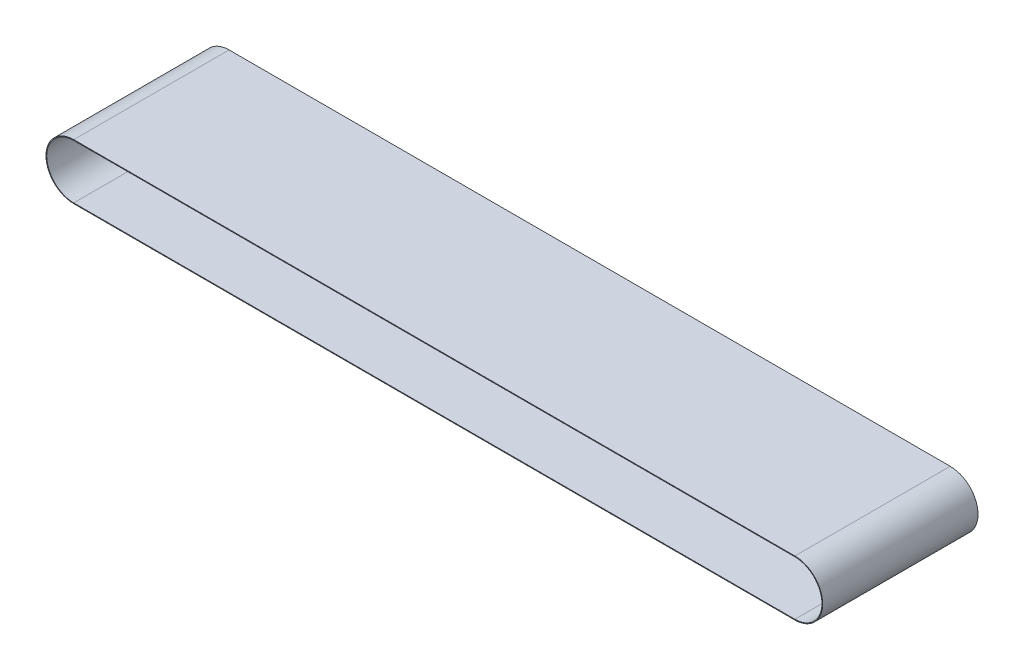
ISO-10303-21;
HEADER;
FILE_DESCRIPTION(('STEP AP214'),'2;1');
FILE_NAME('part.step','',(''),(''),'','','');
FILE_SCHEMA(('AUTOMOTIVE_DESIGN { 1 0 10303 214 1 1 1 1 }'));
ENDSEC;
DATA;
#1=APPLICATION_CONTEXT('core data for automotive mechanical design processes');
#2=APPLICATION_PROTOCOL_DEFINITION('international standard','automotive_design',2000,#1);
#3=PRODUCT_CONTEXT('',#1,'mechanical');
#4=PRODUCT('Part','Part','',(#3));
#5=PRODUCT_RELATED_PRODUCT_CATEGORY('part','',(#4));
#6=PRODUCT_DEFINITION_FORMATION('','',#4);
#7=PRODUCT_DEFINITION_CONTEXT('part definition',#1,'design');
#8=PRODUCT_DEFINITION('design','',#6,#7);
#9=PRODUCT_DEFINITION_SHAPE('','',#8);
#10=(LENGTH_UNIT() NAMED_UNIT(*) SI_UNIT(.MILLI.,.METRE.));
#11=(NAMED_UNIT(*) PLANE_ANGLE_UNIT() SI_UNIT($,.RADIAN.));
#12=(NAMED_UNIT(*) SI_UNIT($,.STERADIAN.) SOLID_ANGLE_UNIT());
#13=UNCERTAINTY_MEASURE_WITH_UNIT(LENGTH_MEASURE(1.E-05),#10,'distance_accuracy_value','');
#14=(GEOMETRIC_REPRESENTATION_CONTEXT(3) GLOBAL_UNCERTAINTY_ASSIGNED_CONTEXT((#13)) GLOBAL_UNIT_ASSIGNED_CONTEXT((#10,
#11,#12)) REPRESENTATION_CONTEXT('',''));
#15=CARTESIAN_POINT('',(0.,0.,0.));
#16=DIRECTION('',(0.,0.,1.));
#17=DIRECTION('',(1.,0.,0.));
#18=AXIS2_PLACEMENT_3D('',#15,#16,#17);
#19=CARTESIAN_POINT('',(-255.3,-2.35040336926356E-13,110.));
#20=DIRECTION('',(0.,0.,1.));
#21=DIRECTION('',(1.,0.,0.));
#22=AXIS2_PLACEMENT_3D('',#19,#20,#21);
#23=PLANE('',#22);
#24=CARTESIAN_POINT('',(-255.3,-2.35040336926356E-13,110.));
#25=DIRECTION('',(0.,0.,1.));
#26=DIRECTION('',(1.,0.,0.));
#27=AXIS2_PLACEMENT_3D('',#24,#25,#26);
#28=CIRCLE('',#27,19.65);
#29=CARTESIAN_POINT('',(-255.3,19.6499999999999,110.));
#30=VERTEX_POINT('',#29);
#31=CARTESIAN_POINT('',(-255.3,-19.6500000000001,110.));
#32=VERTEX_POINT('',#31);
#33=EDGE_CURVE('E153',#30,#32,#28,.T.);
#34=ORIENTED_EDGE('',*,*,#33,.T.);
#35=DIRECTION('',(1.,0.,0.));
#36=VECTOR('',#35,1.);
#37=CARTESIAN_POINT('',(-255.3,-19.6500000000001,110.));
#38=LINE('',#37,#36);
#39=CARTESIAN_POINT('',(255.3,-19.6500000000001,110.));
#40=VERTEX_POINT('',#39);
#41=EDGE_CURVE('E157',#32,#40,#38,.T.);
#42=ORIENTED_EDGE('',*,*,#41,.T.);
#43=CARTESIAN_POINT('',(255.3,-1.4124463857966E-13,110.));
#44=DIRECTION('',(0.,0.,1.));
#45=DIRECTION('',(1.,0.,0.));
#46=AXIS2_PLACEMENT_3D('',#43,#44,#45);
#47=CIRCLE('',#46,19.65);
#48=CARTESIAN_POINT('',(255.3,19.6499999999999,110.));
#49=VERTEX_POINT('',#48);
#50=EDGE_CURVE('E161',#40,#49,#47,.T.);
#51=ORIENTED_EDGE('',*,*,#50,.T.);
#52=DIRECTION('',(-1.,0.,0.));
#53=VECTOR('',#52,1.);
#54=CARTESIAN_POINT('',(-255.3,19.6499999999999,110.));
#55=LINE('',#54,#53);
#56=EDGE_CURVE('E164',#49,#30,#55,.T.);
#57=ORIENTED_EDGE('',*,*,#56,.T.);
#58=EDGE_LOOP('',(#34,#42,#51,#57));
#59=FACE_BOUND('',#58,.T.);
#60=DIRECTION('',(1.,0.,0.));
#61=VECTOR('',#60,1.);
#62=CARTESIAN_POINT('',(-255.3,-19.1500000000001,110.));
#63=LINE('',#62,#61);
#64=CARTESIAN_POINT('',(-255.3,-19.1500000000001,110.));
#65=VERTEX_POINT('',#64);
#66=CARTESIAN_POINT('',(255.3,-19.1500000000001,110.));
#67=VERTEX_POINT('',#66);
#68=EDGE_CURVE('E114',#65,#67,#63,.T.);
#69=ORIENTED_EDGE('',*,*,#68,.F.);
#70=CARTESIAN_POINT('',(-255.3,-2.35040336926356E-13,110.));
#71=DIRECTION('',(0.,0.,1.));
#72=DIRECTION('',(1.,0.,0.));
#73=AXIS2_PLACEMENT_3D('',#70,#71,#72);
#74=CIRCLE('',#73,19.15);
#75=CARTESIAN_POINT('',(-255.3,19.1499999999999,110.));
#76=VERTEX_POINT('',#75);
#77=EDGE_CURVE('E105',#76,#65,#74,.T.);
#78=ORIENTED_EDGE('',*,*,#77,.F.);
#79=DIRECTION('',(-1.,0.,0.));
#80=VECTOR('',#79,1.);
#81=CARTESIAN_POINT('',(-255.3,19.1499999999999,110.));
#82=LINE('',#81,#80);
#83=CARTESIAN_POINT('',(255.3,19.1499999999999,110.));
#84=VERTEX_POINT('',#83);
#85=EDGE_CURVE('E131',#84,#76,#82,.T.);
#86=ORIENTED_EDGE('',*,*,#85,.F.);
#87=CARTESIAN_POINT('',(255.3,-1.4124463857966E-13,110.));
#88=DIRECTION('',(0.,0.,1.));
#89=DIRECTION('',(1.,0.,0.));
#90=AXIS2_PLACEMENT_3D('',#87,#88,#89);
#91=CIRCLE('',#90,19.15);
#92=EDGE_CURVE('E127',#67,#84,#91,.T.);
#93=ORIENTED_EDGE('',*,*,#92,.F.);
#94=EDGE_LOOP('',(#69,#78,#86,#93));
#95=FACE_BOUND('',#94,.T.);
#96=ADVANCED_FACE('F39',(#59,#95),#23,.T.);
#97=CARTESIAN_POINT('',(-255.3,-2.35040336926356E-13,0.));
#98=DIRECTION('',(0.,0.,1.));
#99=DIRECTION('',(1.,0.,0.));
#100=AXIS2_PLACEMENT_3D('',#97,#98,#99);
#101=PLANE('',#100);
#102=CARTESIAN_POINT('',(-255.3,-2.35040336926356E-13,0.));
#103=DIRECTION('',(0.,0.,1.));
#104=DIRECTION('',(1.,0.,0.));
#105=AXIS2_PLACEMENT_3D('',#102,#103,#104);
#106=CIRCLE('',#105,19.65);
#107=CARTESIAN_POINT('',(-255.3,19.6499999999999,0.));
#108=VERTEX_POINT('',#107);
#109=CARTESIAN_POINT('',(-255.3,-19.6500000000001,0.));
#110=VERTEX_POINT('',#109);
#111=EDGE_CURVE('E123',#108,#110,#106,.T.);
#112=ORIENTED_EDGE('',*,*,#111,.F.);
#113=DIRECTION('',(-1.,0.,0.));
#114=VECTOR('',#113,1.);
#115=CARTESIAN_POINT('',(-255.3,19.6499999999999,0.));
#116=LINE('',#115,#114);
#117=CARTESIAN_POINT('',(255.3,19.6499999999999,0.));
#118=VERTEX_POINT('',#117);
#119=EDGE_CURVE('E158',#118,#108,#116,.T.);
#120=ORIENTED_EDGE('',*,*,#119,.F.);
#121=CARTESIAN_POINT('',(255.3,-1.4124463857966E-13,0.));
#122=DIRECTION('',(0.,0.,1.));
#123=DIRECTION('',(1.,0.,0.));
#124=AXIS2_PLACEMENT_3D('',#121,#122,#123);
#125=CIRCLE('',#124,19.65);
#126=CARTESIAN_POINT('',(255.3,-19.6500000000001,0.));
#127=VERTEX_POINT('',#126);
#128=EDGE_CURVE('E174',#127,#118,#125,.T.);
#129=ORIENTED_EDGE('',*,*,#128,.F.);
#130=DIRECTION('',(1.,0.,0.));
#131=VECTOR('',#130,1.);
#132=CARTESIAN_POINT('',(-255.3,-19.6500000000001,0.));
#133=LINE('',#132,#131);
#134=EDGE_CURVE('E171',#110,#127,#133,.T.);
#135=ORIENTED_EDGE('',*,*,#134,.F.);
#136=EDGE_LOOP('',(#112,#120,#129,#135));
#137=FACE_BOUND('',#136,.T.);
#138=CARTESIAN_POINT('',(-255.3,-2.35040336926356E-13,0.));
#139=DIRECTION('',(0.,0.,1.));
#140=DIRECTION('',(1.,0.,0.));
#141=AXIS2_PLACEMENT_3D('',#138,#139,#140);
#142=CIRCLE('',#141,19.15);
#143=CARTESIAN_POINT('',(-255.3,19.1499999999999,0.));
#144=VERTEX_POINT('',#143);
#145=CARTESIAN_POINT('',(-255.3,-19.1500000000001,0.));
#146=VERTEX_POINT('',#145);
#147=EDGE_CURVE('E63',#144,#146,#142,.T.);
#148=ORIENTED_EDGE('',*,*,#147,.T.);
#149=DIRECTION('',(1.,0.,0.));
#150=VECTOR('',#149,1.);
#151=CARTESIAN_POINT('',(-255.3,-19.1500000000001,0.));
#152=LINE('',#151,#150);
#153=CARTESIAN_POINT('',(255.3,-19.1500000000001,0.));
#154=VERTEX_POINT('',#153);
#155=EDGE_CURVE('E121',#146,#154,#152,.T.);
#156=ORIENTED_EDGE('',*,*,#155,.T.);
#157=CARTESIAN_POINT('',(255.3,-1.4124463857966E-13,0.));
#158=DIRECTION('',(0.,0.,1.));
#159=DIRECTION('',(1.,0.,0.));
#160=AXIS2_PLACEMENT_3D('',#157,#158,#159);
#161=CIRCLE('',#160,19.15);
#162=CARTESIAN_POINT('',(255.3,19.1499999999999,0.));
#163=VERTEX_POINT('',#162);
#164=EDGE_CURVE('E140',#154,#163,#161,.T.);
#165=ORIENTED_EDGE('',*,*,#164,.T.);
#166=DIRECTION('',(-1.,0.,0.));
#167=VECTOR('',#166,1.);
#168=CARTESIAN_POINT('',(-255.3,19.1499999999999,0.));
#169=LINE('',#168,#167);
#170=EDGE_CURVE('E115',#163,#144,#169,.T.);
#171=ORIENTED_EDGE('',*,*,#170,.T.);
#172=EDGE_LOOP('',(#148,#156,#165,#171));
#173=FACE_BOUND('',#172,.T.);
#174=ADVANCED_FACE('F197',(#137,#173),#101,.F.);
#175=CARTESIAN_POINT('',(-255.3,-2.35040336926356E-13,110.));
#176=DIRECTION('',(0.,0.,-1.));
#177=DIRECTION('',(-1.,0.,0.));
#178=AXIS2_PLACEMENT_3D('',#175,#176,#177);
#179=CYLINDRICAL_SURFACE('',#178,19.65);
#180=ORIENTED_EDGE('',*,*,#111,.T.);
#181=DIRECTION('',(0.,0.,-1.));
#182=VECTOR('',#181,1.);
#183=CARTESIAN_POINT('',(-255.3,-19.6500000000001,110.));
#184=LINE('',#183,#182);
#185=EDGE_CURVE('E11',#32,#110,#184,.T.);
#186=ORIENTED_EDGE('',*,*,#185,.F.);
#187=ORIENTED_EDGE('',*,*,#33,.F.);
#188=DIRECTION('',(0.,0.,-1.));
#189=VECTOR('',#188,1.);
#190=CARTESIAN_POINT('',(-255.3,19.6499999999999,110.));
#191=LINE('',#190,#189);
#192=EDGE_CURVE('E167',#30,#108,#191,.T.);
#193=ORIENTED_EDGE('',*,*,#192,.T.);
#194=EDGE_LOOP('',(#180,#186,#187,#193));
#195=FACE_BOUND('',#194,.T.);
#196=ADVANCED_FACE('F41',(#195),#179,.T.);
#197=CARTESIAN_POINT('',(-255.3,-19.6500000000001,110.));
#198=DIRECTION('',(0.,1.,0.));
#199=DIRECTION('',(0.,0.,1.));
#200=AXIS2_PLACEMENT_3D('',#197,#198,#199);
#201=PLANE('',#200);
#202=ORIENTED_EDGE('',*,*,#134,.T.);
#203=DIRECTION('',(0.,0.,-1.));
#204=VECTOR('',#203,1.);
#205=CARTESIAN_POINT('',(255.3,-19.6500000000001,110.));
#206=LINE('',#205,#204);
#207=EDGE_CURVE('E48',#40,#127,#206,.T.);
#208=ORIENTED_EDGE('',*,*,#207,.F.);
#209=ORIENTED_EDGE('',*,*,#41,.F.);
#210=ORIENTED_EDGE('',*,*,#185,.T.);
#211=EDGE_LOOP('',(#202,#208,#209,#210));
#212=FACE_BOUND('',#211,.T.);
#213=ADVANCED_FACE('F207',(#212),#201,.F.);
#214=CARTESIAN_POINT('',(255.3,-1.4124463857966E-13,110.));
#215=DIRECTION('',(0.,0.,-1.));
#216=DIRECTION('',(-1.,0.,0.));
#217=AXIS2_PLACEMENT_3D('',#214,#215,#216);
#218=CYLINDRICAL_SURFACE('',#217,19.65);
#219=ORIENTED_EDGE('',*,*,#128,.T.);
#220=DIRECTION('',(0.,0.,-1.));
#221=VECTOR('',#220,1.);
#222=CARTESIAN_POINT('',(255.3,19.6499999999999,110.));
#223=LINE('',#222,#221);
#224=EDGE_CURVE('E182',#49,#118,#223,.T.);
#225=ORIENTED_EDGE('',*,*,#224,.F.);
#226=ORIENTED_EDGE('',*,*,#50,.F.);
#227=ORIENTED_EDGE('',*,*,#207,.T.);
#228=EDGE_LOOP('',(#219,#225,#226,#227));
#229=FACE_BOUND('',#228,.T.);
#230=ADVANCED_FACE('F191',(#229),#218,.T.);
#231=CARTESIAN_POINT('',(-255.3,19.6499999999999,110.));
#232=DIRECTION('',(0.,-1.,0.));
#233=DIRECTION('',(0.,0.,-1.));
#234=AXIS2_PLACEMENT_3D('',#231,#232,#233);
#235=PLANE('',#234);
#236=ORIENTED_EDGE('',*,*,#119,.T.);
#237=ORIENTED_EDGE('',*,*,#192,.F.);
#238=ORIENTED_EDGE('',*,*,#56,.F.);
#239=ORIENTED_EDGE('',*,*,#224,.T.);
#240=EDGE_LOOP('',(#236,#237,#238,#239));
#241=FACE_BOUND('',#240,.T.);
#242=ADVANCED_FACE('F201',(#241),#235,.F.);
#243=CARTESIAN_POINT('',(-255.3,-2.35040336926356E-13,110.));
#244=DIRECTION('',(0.,0.,-1.));
#245=DIRECTION('',(-1.,0.,0.));
#246=AXIS2_PLACEMENT_3D('',#243,#244,#245);
#247=CYLINDRICAL_SURFACE('',#246,19.15);
#248=ORIENTED_EDGE('',*,*,#147,.F.);
#249=DIRECTION('',(0.,0.,-1.));
#250=VECTOR('',#249,1.);
#251=CARTESIAN_POINT('',(-255.3,19.1499999999999,110.));
#252=LINE('',#251,#250);
#253=EDGE_CURVE('E109',#76,#144,#252,.T.);
#254=ORIENTED_EDGE('',*,*,#253,.F.);
#255=ORIENTED_EDGE('',*,*,#77,.T.);
#256=DIRECTION('',(0.,0.,-1.));
#257=VECTOR('',#256,1.);
#258=CARTESIAN_POINT('',(-255.3,-19.1500000000001,110.));
#259=LINE('',#258,#257);
#260=EDGE_CURVE('E108',#65,#146,#259,.T.);
#261=ORIENTED_EDGE('',*,*,#260,.T.);
#262=EDGE_LOOP('',(#248,#254,#255,#261));
#263=FACE_BOUND('',#262,.T.);
#264=ADVANCED_FACE('F107',(#263),#247,.F.);
#265=CARTESIAN_POINT('',(-255.3,-19.1500000000001,110.));
#266=DIRECTION('',(0.,1.,0.));
#267=DIRECTION('',(-1.,0.,0.));
#268=AXIS2_PLACEMENT_3D('',#265,#266,#267);
#269=PLANE('',#268);
#270=ORIENTED_EDGE('',*,*,#155,.F.);
#271=ORIENTED_EDGE('',*,*,#260,.F.);
#272=ORIENTED_EDGE('',*,*,#68,.T.);
#273=DIRECTION('',(0.,0.,-1.));
#274=VECTOR('',#273,1.);
#275=CARTESIAN_POINT('',(255.3,-19.1500000000001,110.));
#276=LINE('',#275,#274);
#277=EDGE_CURVE('E124',#67,#154,#276,.T.);
#278=ORIENTED_EDGE('',*,*,#277,.T.);
#279=EDGE_LOOP('',(#270,#271,#272,#278));
#280=FACE_BOUND('',#279,.T.);
#281=ADVANCED_FACE('F118',(#280),#269,.T.);
#282=CARTESIAN_POINT('',(255.3,-1.4124463857966E-13,110.));
#283=DIRECTION('',(0.,0.,-1.));
#284=DIRECTION('',(-1.,0.,0.));
#285=AXIS2_PLACEMENT_3D('',#282,#283,#284);
#286=CYLINDRICAL_SURFACE('',#285,19.15);
#287=ORIENTED_EDGE('',*,*,#164,.F.);
#288=ORIENTED_EDGE('',*,*,#277,.F.);
#289=ORIENTED_EDGE('',*,*,#92,.T.);
#290=DIRECTION('',(0.,0.,-1.));
#291=VECTOR('',#290,1.);
#292=CARTESIAN_POINT('',(255.3,19.1499999999999,110.));
#293=LINE('',#292,#291);
#294=EDGE_CURVE('E55',#84,#163,#293,.T.);
#295=ORIENTED_EDGE('',*,*,#294,.T.);
#296=EDGE_LOOP('',(#287,#288,#289,#295));
#297=FACE_BOUND('',#296,.T.);
#298=ADVANCED_FACE('F230',(#297),#286,.F.);
#299=CARTESIAN_POINT('',(-255.3,19.1499999999999,110.));
#300=DIRECTION('',(0.,-1.,0.));
#301=DIRECTION('',(1.,0.,0.));
#302=AXIS2_PLACEMENT_3D('',#299,#300,#301);
#303=PLANE('',#302);
#304=ORIENTED_EDGE('',*,*,#170,.F.);
#305=ORIENTED_EDGE('',*,*,#294,.F.);
#306=ORIENTED_EDGE('',*,*,#85,.T.);
#307=ORIENTED_EDGE('',*,*,#253,.T.);
#308=EDGE_LOOP('',(#304,#305,#306,#307));
#309=FACE_BOUND('',#308,.T.);
#310=ADVANCED_FACE('F234',(#309),#303,.T.);
#311=CLOSED_SHELL('',(#96,#174,#196,#213,#230,#242,#264,#281,#298,#310));
#312=MANIFOLD_SOLID_BREP('B2',#311);
#313=ADVANCED_BREP_SHAPE_REPRESENTATION('',(#18,#312),#14);
#314=SHAPE_DEFINITION_REPRESENTATION(#9,#313);
ENDSEC;
END-ISO-10303-21;
